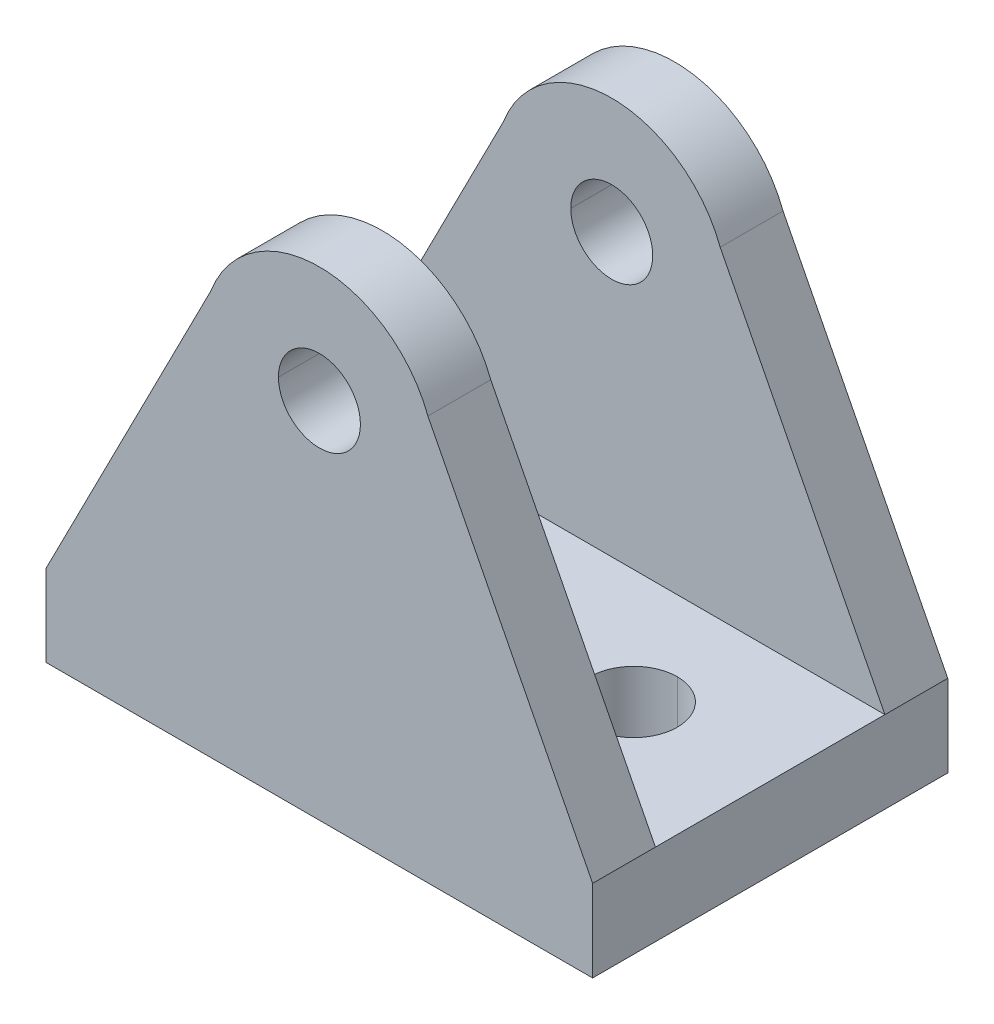
ISO-10303-21;
HEADER;
FILE_DESCRIPTION(('STEP AP214'),'2;1');
FILE_NAME('part.step','',(''),(''),'','','');
FILE_SCHEMA(('AUTOMOTIVE_DESIGN { 1 0 10303 214 1 1 1 1 }'));
ENDSEC;
DATA;
#1=APPLICATION_CONTEXT('core data for automotive mechanical design processes');
#2=APPLICATION_PROTOCOL_DEFINITION('international standard','automotive_design',2000,#1);
#3=PRODUCT_CONTEXT('',#1,'mechanical');
#4=PRODUCT('Part','Part','',(#3));
#5=PRODUCT_RELATED_PRODUCT_CATEGORY('part','',(#4));
#6=PRODUCT_DEFINITION_FORMATION('','',#4);
#7=PRODUCT_DEFINITION_CONTEXT('part definition',#1,'design');
#8=PRODUCT_DEFINITION('design','',#6,#7);
#9=PRODUCT_DEFINITION_SHAPE('','',#8);
#10=(LENGTH_UNIT() NAMED_UNIT(*) SI_UNIT(.MILLI.,.METRE.));
#11=(NAMED_UNIT(*) PLANE_ANGLE_UNIT() SI_UNIT($,.RADIAN.));
#12=(NAMED_UNIT(*) SI_UNIT($,.STERADIAN.) SOLID_ANGLE_UNIT());
#13=UNCERTAINTY_MEASURE_WITH_UNIT(LENGTH_MEASURE(1.E-05),#10,'distance_accuracy_value','');
#14=(GEOMETRIC_REPRESENTATION_CONTEXT(3) GLOBAL_UNCERTAINTY_ASSIGNED_CONTEXT((#13)) GLOBAL_UNIT_ASSIGNED_CONTEXT((#10,
#11,#12)) REPRESENTATION_CONTEXT('',''));
#15=CARTESIAN_POINT('',(0.,0.,0.));
#16=DIRECTION('',(0.,0.,1.));
#17=DIRECTION('',(1.,0.,0.));
#18=AXIS2_PLACEMENT_3D('',#15,#16,#17);
#19=CARTESIAN_POINT('',(16.3430756374336,3.,-51.9194258680596));
#20=DIRECTION('',(0.,0.,-1.));
#21=DIRECTION('',(0.,-1.,0.));
#22=AXIS2_PLACEMENT_3D('',#19,#20,#21);
#23=PLANE('',#22);
#24=CARTESIAN_POINT('',(35.3430691595237,13.3000053075812,-51.9194258680596));
#25=DIRECTION('',(0.,0.,-1.));
#26=DIRECTION('',(-1.,0.,0.));
#27=AXIS2_PLACEMENT_3D('',#24,#25,#26);
#28=CIRCLE('',#27,1.50000000000006);
#29=CARTESIAN_POINT('',(36.8430691595238,13.3000053075812,-51.9194258680596));
#30=VERTEX_POINT('',#29);
#31=CARTESIAN_POINT('',(33.8430691595237,13.3000053075812,-51.9194258680596));
#32=VERTEX_POINT('',#31);
#33=EDGE_CURVE('E210',#30,#32,#28,.T.);
#34=ORIENTED_EDGE('',*,*,#33,.T.);
#35=CARTESIAN_POINT('',(35.3430691595237,13.3000053075812,-51.9194258680596));
#36=DIRECTION('',(0.,0.,-1.));
#37=DIRECTION('',(-1.,0.,0.));
#38=AXIS2_PLACEMENT_3D('',#35,#36,#37);
#39=CIRCLE('',#38,1.50000000000006);
#40=EDGE_CURVE('E11',#32,#30,#39,.T.);
#41=ORIENTED_EDGE('',*,*,#40,.T.);
#42=EDGE_LOOP('',(#34,#41));
#43=FACE_BOUND('',#42,.T.);
#44=DIRECTION('',(1.,0.,0.));
#45=VECTOR('',#44,1.);
#46=CARTESIAN_POINT('',(16.3430756374336,3.,-51.9194258680596));
#47=LINE('',#46,#45);
#48=CARTESIAN_POINT('',(25.3430756374336,3.,-51.9194258680596));
#49=VERTEX_POINT('',#48);
#50=CARTESIAN_POINT('',(45.3430756374336,3.,-51.9194258680596));
#51=VERTEX_POINT('',#50);
#52=EDGE_CURVE('E366',#49,#51,#47,.T.);
#53=ORIENTED_EDGE('',*,*,#52,.T.);
#54=DIRECTION('',(0.454991131058374,-0.890495968917446,0.));
#55=VECTOR('',#54,1.);
#56=CARTESIAN_POINT('',(45.3430756374336,3.,-51.9194258680596));
#57=LINE('',#56,#55);
#58=CARTESIAN_POINT('',(39.313966075132,14.8000053075813,-51.9194258680596));
#59=VERTEX_POINT('',#58);
#60=EDGE_CURVE('E26',#59,#51,#57,.T.);
#61=ORIENTED_EDGE('',*,*,#60,.F.);
#62=CARTESIAN_POINT('',(35.3430691595237,13.3000053075812,-51.9194258680596));
#63=DIRECTION('',(0.,0.,-1.));
#64=DIRECTION('',(-1.,0.,0.));
#65=AXIS2_PLACEMENT_3D('',#62,#63,#64);
#66=CIRCLE('',#65,4.24476410585876);
#67=CARTESIAN_POINT('',(31.3721722439155,14.8000053075813,-51.9194258680596));
#68=VERTEX_POINT('',#67);
#69=EDGE_CURVE('E244',#68,#59,#66,.T.);
#70=ORIENTED_EDGE('',*,*,#69,.F.);
#71=DIRECTION('',(0.454990355742183,0.890496365058051,0.));
#72=VECTOR('',#71,1.);
#73=CARTESIAN_POINT('',(31.3721722439155,14.8000053075813,-51.9194258680596));
#74=LINE('',#73,#72);
#75=EDGE_CURVE('E245',#49,#68,#74,.T.);
#76=ORIENTED_EDGE('',*,*,#75,.F.);
#77=EDGE_LOOP('',(#53,#61,#70,#76));
#78=FACE_BOUND('',#77,.T.);
#79=ADVANCED_FACE('F16',(#43,#78),#23,.F.);
#80=CARTESIAN_POINT('',(16.3430756374336,3.,-43.5194258680597));
#81=DIRECTION('',(0.,0.,1.));
#82=DIRECTION('',(1.,0.,0.));
#83=AXIS2_PLACEMENT_3D('',#80,#81,#82);
#84=PLANE('',#83);
#85=CARTESIAN_POINT('',(35.3430756374336,13.3,-43.5194258680597));
#86=DIRECTION('',(0.,0.,1.));
#87=DIRECTION('',(1.,0.,0.));
#88=AXIS2_PLACEMENT_3D('',#85,#86,#87);
#89=CIRCLE('',#88,1.50000000000006);
#90=CARTESIAN_POINT('',(33.8430756374335,13.3,-43.5194258680597));
#91=VERTEX_POINT('',#90);
#92=CARTESIAN_POINT('',(36.8430756374336,13.3,-43.5194258680597));
#93=VERTEX_POINT('',#92);
#94=EDGE_CURVE('E402',#91,#93,#89,.T.);
#95=ORIENTED_EDGE('',*,*,#94,.T.);
#96=CARTESIAN_POINT('',(35.3430756374336,13.3,-43.5194258680597));
#97=DIRECTION('',(0.,0.,1.));
#98=DIRECTION('',(1.,0.,0.));
#99=AXIS2_PLACEMENT_3D('',#96,#97,#98);
#100=CIRCLE('',#99,1.50000000000006);
#101=EDGE_CURVE('E257',#93,#91,#100,.T.);
#102=ORIENTED_EDGE('',*,*,#101,.T.);
#103=EDGE_LOOP('',(#95,#102));
#104=FACE_BOUND('',#103,.T.);
#105=DIRECTION('',(1.,0.,0.));
#106=VECTOR('',#105,1.);
#107=CARTESIAN_POINT('',(16.3430756374336,3.,-43.5194258680597));
#108=LINE('',#107,#106);
#109=CARTESIAN_POINT('',(25.3430756374336,3.,-43.5194258680597));
#110=VERTEX_POINT('',#109);
#111=CARTESIAN_POINT('',(45.3430756374336,3.,-43.5194258680597));
#112=VERTEX_POINT('',#111);
#113=EDGE_CURVE('E299',#110,#112,#108,.T.);
#114=ORIENTED_EDGE('',*,*,#113,.F.);
#115=DIRECTION('',(-0.45499090568648,-0.890496084069209,0.));
#116=VECTOR('',#115,1.);
#117=CARTESIAN_POINT('',(25.3430756374336,3.,-43.5194258680597));
#118=LINE('',#117,#116);
#119=CARTESIAN_POINT('',(31.3721787218253,14.8,-43.5194258680597));
#120=VERTEX_POINT('',#119);
#121=EDGE_CURVE('E261',#120,#110,#118,.T.);
#122=ORIENTED_EDGE('',*,*,#121,.F.);
#123=CARTESIAN_POINT('',(35.3430756374336,13.3,-43.5194258680597));
#124=DIRECTION('',(0.,0.,1.));
#125=DIRECTION('',(1.,0.,0.));
#126=AXIS2_PLACEMENT_3D('',#123,#124,#125);
#127=CIRCLE('',#126,4.24476410585876);
#128=CARTESIAN_POINT('',(39.3139725530418,14.8,-43.5194258680597));
#129=VERTEX_POINT('',#128);
#130=EDGE_CURVE('E229',#129,#120,#127,.T.);
#131=ORIENTED_EDGE('',*,*,#130,.F.);
#132=DIRECTION('',(-0.45499090568648,0.890496084069209,0.));
#133=VECTOR('',#132,1.);
#134=CARTESIAN_POINT('',(39.3139725530418,14.8,-43.5194258680597));
#135=LINE('',#134,#133);
#136=EDGE_CURVE('E230',#112,#129,#135,.T.);
#137=ORIENTED_EDGE('',*,*,#136,.F.);
#138=EDGE_LOOP('',(#114,#122,#131,#137));
#139=FACE_BOUND('',#138,.T.);
#140=ADVANCED_FACE('F459',(#104,#139),#84,.F.);
#141=CARTESIAN_POINT('',(35.3430691595237,13.3000053075812,-54.2194258680596));
#142=DIRECTION('',(0.,0.,1.));
#143=DIRECTION('',(1.,0.,0.));
#144=AXIS2_PLACEMENT_3D('',#141,#142,#143);
#145=CYLINDRICAL_SURFACE('',#144,1.50000000000006);
#146=DIRECTION('',(0.,0.,1.));
#147=VECTOR('',#146,1.);
#148=CARTESIAN_POINT('',(33.8430691595237,13.3000053075812,-54.2194258680596));
#149=LINE('',#148,#147);
#150=CARTESIAN_POINT('',(33.8430691595237,13.3000053075812,-54.2194258680596));
#151=VERTEX_POINT('',#150);
#152=EDGE_CURVE('E204',#151,#32,#149,.T.);
#153=ORIENTED_EDGE('',*,*,#152,.F.);
#154=CARTESIAN_POINT('',(35.3430691595237,13.3000053075812,-54.2194258680596));
#155=DIRECTION('',(0.,0.,-1.));
#156=DIRECTION('',(-1.,0.,0.));
#157=AXIS2_PLACEMENT_3D('',#154,#155,#156);
#158=CIRCLE('',#157,1.50000000000006);
#159=CARTESIAN_POINT('',(36.8430691595238,13.3000053075812,-54.2194258680596));
#160=VERTEX_POINT('',#159);
#161=EDGE_CURVE('E388',#151,#160,#158,.T.);
#162=ORIENTED_EDGE('',*,*,#161,.T.);
#163=DIRECTION('',(0.,0.,1.));
#164=VECTOR('',#163,1.);
#165=CARTESIAN_POINT('',(36.8430691595238,13.3000053075812,-54.2194258680596));
#166=LINE('',#165,#164);
#167=EDGE_CURVE('E207',#160,#30,#166,.T.);
#168=ORIENTED_EDGE('',*,*,#167,.T.);
#169=ORIENTED_EDGE('',*,*,#40,.F.);
#170=EDGE_LOOP('',(#153,#162,#168,#169));
#171=FACE_BOUND('',#170,.T.);
#172=ADVANCED_FACE('F202',(#171),#145,.F.);
#173=CARTESIAN_POINT('',(45.3430756374336,3.,-54.2194258680596));
#174=DIRECTION('',(-0.890495968917446,-0.454991131058374,0.));
#175=DIRECTION('',(-0.454991131058374,0.890495968917446,0.));
#176=AXIS2_PLACEMENT_3D('',#173,#174,#175);
#177=PLANE('',#176);
#178=DIRECTION('',(0.,0.,1.));
#179=VECTOR('',#178,1.);
#180=CARTESIAN_POINT('',(39.313966075132,14.8000053075813,-54.2194258680596));
#181=LINE('',#180,#179);
#182=CARTESIAN_POINT('',(39.313966075132,14.8000053075813,-54.2194258680596));
#183=VERTEX_POINT('',#182);
#184=EDGE_CURVE('E294',#183,#59,#181,.T.);
#185=ORIENTED_EDGE('',*,*,#184,.T.);
#186=ORIENTED_EDGE('',*,*,#60,.T.);
#187=DIRECTION('',(0.,0.,1.));
#188=VECTOR('',#187,1.);
#189=CARTESIAN_POINT('',(45.3430756374336,3.,-54.2194258680596));
#190=LINE('',#189,#188);
#191=CARTESIAN_POINT('',(45.3430756374336,3.,-54.2194258680596));
#192=VERTEX_POINT('',#191);
#193=EDGE_CURVE('E282',#192,#51,#190,.T.);
#194=ORIENTED_EDGE('',*,*,#193,.F.);
#195=DIRECTION('',(0.454991131058374,-0.890495968917446,0.));
#196=VECTOR('',#195,1.);
#197=CARTESIAN_POINT('',(45.3430756374336,3.,-54.2194258680596));
#198=LINE('',#197,#196);
#199=EDGE_CURVE('E19',#183,#192,#198,.T.);
#200=ORIENTED_EDGE('',*,*,#199,.F.);
#201=EDGE_LOOP('',(#185,#186,#194,#200));
#202=FACE_BOUND('',#201,.T.);
#203=ADVANCED_FACE('F480',(#202),#177,.F.);
#204=CARTESIAN_POINT('',(35.3430691595237,13.3000053075812,-54.2194258680596));
#205=DIRECTION('',(0.,0.,1.));
#206=DIRECTION('',(1.,0.,0.));
#207=AXIS2_PLACEMENT_3D('',#204,#205,#206);
#208=CYLINDRICAL_SURFACE('',#207,4.24476410585876);
#209=DIRECTION('',(0.,0.,1.));
#210=VECTOR('',#209,1.);
#211=CARTESIAN_POINT('',(31.3721722439155,14.8000053075813,-54.2194258680596));
#212=LINE('',#211,#210);
#213=CARTESIAN_POINT('',(31.3721722439155,14.8000053075813,-54.2194258680596));
#214=VERTEX_POINT('',#213);
#215=EDGE_CURVE('E240',#214,#68,#212,.T.);
#216=ORIENTED_EDGE('',*,*,#215,.T.);
#217=ORIENTED_EDGE('',*,*,#69,.T.);
#218=ORIENTED_EDGE('',*,*,#184,.F.);
#219=CARTESIAN_POINT('',(35.3430691595237,13.3000053075812,-54.2194258680596));
#220=DIRECTION('',(0.,0.,-1.));
#221=DIRECTION('',(1.,0.,0.));
#222=AXIS2_PLACEMENT_3D('',#219,#220,#221);
#223=CIRCLE('',#222,4.24476410585876);
#224=EDGE_CURVE('E271',#214,#183,#223,.T.);
#225=ORIENTED_EDGE('',*,*,#224,.F.);
#226=EDGE_LOOP('',(#216,#217,#218,#225));
#227=FACE_BOUND('',#226,.T.);
#228=ADVANCED_FACE('F493',(#227),#208,.T.);
#229=CARTESIAN_POINT('',(31.3721722439155,14.8000053075813,-54.2194258680596));
#230=DIRECTION('',(0.890496365058051,-0.454990355742182,0.));
#231=DIRECTION('',(0.,0.,-1.));
#232=AXIS2_PLACEMENT_3D('',#229,#230,#231);
#233=PLANE('',#232);
#234=DIRECTION('',(0.,0.,1.));
#235=VECTOR('',#234,1.);
#236=CARTESIAN_POINT('',(25.3430756374336,3.,-54.2194258680596));
#237=LINE('',#236,#235);
#238=CARTESIAN_POINT('',(25.3430756374336,3.,-54.2194258680596));
#239=VERTEX_POINT('',#238);
#240=EDGE_CURVE('E262',#239,#49,#237,.T.);
#241=ORIENTED_EDGE('',*,*,#240,.T.);
#242=ORIENTED_EDGE('',*,*,#75,.T.);
#243=ORIENTED_EDGE('',*,*,#215,.F.);
#244=DIRECTION('',(0.454990355742183,0.890496365058051,0.));
#245=VECTOR('',#244,1.);
#246=CARTESIAN_POINT('',(31.3721722439155,14.8000053075813,-54.2194258680596));
#247=LINE('',#246,#245);
#248=EDGE_CURVE('E260',#239,#214,#247,.T.);
#249=ORIENTED_EDGE('',*,*,#248,.F.);
#250=EDGE_LOOP('',(#241,#242,#243,#249));
#251=FACE_BOUND('',#250,.T.);
#252=ADVANCED_FACE('F456',(#251),#233,.F.);
#253=CARTESIAN_POINT('',(35.3430691595237,13.3000053075812,-54.2194258680596));
#254=DIRECTION('',(0.,0.,1.));
#255=DIRECTION('',(1.,0.,0.));
#256=AXIS2_PLACEMENT_3D('',#253,#254,#255);
#257=PLANE('',#256);
#258=CARTESIAN_POINT('',(35.3430691595237,13.3000053075812,-54.2194258680596));
#259=DIRECTION('',(0.,0.,-1.));
#260=DIRECTION('',(-1.,0.,0.));
#261=AXIS2_PLACEMENT_3D('',#258,#259,#260);
#262=CIRCLE('',#261,1.50000000000006);
#263=EDGE_CURVE('E216',#160,#151,#262,.T.);
#264=ORIENTED_EDGE('',*,*,#263,.F.);
#265=ORIENTED_EDGE('',*,*,#161,.F.);
#266=EDGE_LOOP('',(#264,#265));
#267=FACE_BOUND('',#266,.T.);
#268=DIRECTION('',(0.,-1.,0.));
#269=VECTOR('',#268,1.);
#270=CARTESIAN_POINT('',(45.3430756374336,3.,-54.2194258680596));
#271=LINE('',#270,#269);
#272=CARTESIAN_POINT('',(45.3430756374336,0.,-54.2194258680596));
#273=VERTEX_POINT('',#272);
#274=EDGE_CURVE('E287',#192,#273,#271,.T.);
#275=ORIENTED_EDGE('',*,*,#274,.T.);
#276=DIRECTION('',(-1.,0.,0.));
#277=VECTOR('',#276,1.);
#278=CARTESIAN_POINT('',(45.3430756374336,0.,-54.2194258680596));
#279=LINE('',#278,#277);
#280=CARTESIAN_POINT('',(25.3430756374336,0.,-54.2194258680596));
#281=VERTEX_POINT('',#280);
#282=EDGE_CURVE('E255',#273,#281,#279,.T.);
#283=ORIENTED_EDGE('',*,*,#282,.T.);
#284=DIRECTION('',(0.,1.,0.));
#285=VECTOR('',#284,1.);
#286=CARTESIAN_POINT('',(25.3430756374336,3.,-54.2194258680596));
#287=LINE('',#286,#285);
#288=EDGE_CURVE('E266',#281,#239,#287,.T.);
#289=ORIENTED_EDGE('',*,*,#288,.T.);
#290=ORIENTED_EDGE('',*,*,#248,.T.);
#291=ORIENTED_EDGE('',*,*,#224,.T.);
#292=ORIENTED_EDGE('',*,*,#199,.T.);
#293=EDGE_LOOP('',(#275,#283,#289,#290,#291,#292));
#294=FACE_BOUND('',#293,.T.);
#295=ADVANCED_FACE('F485',(#267,#294),#257,.F.);
#296=CARTESIAN_POINT('',(35.3430756374336,13.3,-41.2194258680597));
#297=DIRECTION('',(0.,0.,-1.));
#298=DIRECTION('',(-1.,0.,0.));
#299=AXIS2_PLACEMENT_3D('',#296,#297,#298);
#300=CYLINDRICAL_SURFACE('',#299,1.50000000000006);
#301=DIRECTION('',(0.,0.,-1.));
#302=VECTOR('',#301,1.);
#303=CARTESIAN_POINT('',(36.8430756374336,13.3,-41.2194258680597));
#304=LINE('',#303,#302);
#305=CARTESIAN_POINT('',(36.8430756374336,13.3,-41.2194258680597));
#306=VERTEX_POINT('',#305);
#307=EDGE_CURVE('E235',#306,#93,#304,.T.);
#308=ORIENTED_EDGE('',*,*,#307,.F.);
#309=CARTESIAN_POINT('',(35.3430756374336,13.3,-41.2194258680597));
#310=DIRECTION('',(0.,0.,1.));
#311=DIRECTION('',(1.,0.,0.));
#312=AXIS2_PLACEMENT_3D('',#309,#310,#311);
#313=CIRCLE('',#312,1.50000000000006);
#314=CARTESIAN_POINT('',(33.8430756374335,13.3,-41.2194258680597));
#315=VERTEX_POINT('',#314);
#316=EDGE_CURVE('E236',#306,#315,#313,.T.);
#317=ORIENTED_EDGE('',*,*,#316,.T.);
#318=DIRECTION('',(0.,0.,-1.));
#319=VECTOR('',#318,1.);
#320=CARTESIAN_POINT('',(33.8430756374335,13.3,-41.2194258680597));
#321=LINE('',#320,#319);
#322=EDGE_CURVE('E226',#315,#91,#321,.T.);
#323=ORIENTED_EDGE('',*,*,#322,.T.);
#324=ORIENTED_EDGE('',*,*,#101,.F.);
#325=EDGE_LOOP('',(#308,#317,#323,#324));
#326=FACE_BOUND('',#325,.T.);
#327=ADVANCED_FACE('F419',(#326),#300,.F.);
#328=CARTESIAN_POINT('',(25.3430756374336,3.,-41.2194258680597));
#329=DIRECTION('',(0.890496084069209,-0.45499090568648,0.));
#330=DIRECTION('',(0.,0.,-1.));
#331=AXIS2_PLACEMENT_3D('',#328,#329,#330);
#332=PLANE('',#331);
#333=DIRECTION('',(0.,0.,-1.));
#334=VECTOR('',#333,1.);
#335=CARTESIAN_POINT('',(31.3721787218253,14.8,-41.2194258680597));
#336=LINE('',#335,#334);
#337=CARTESIAN_POINT('',(31.3721787218253,14.8,-41.2194258680597));
#338=VERTEX_POINT('',#337);
#339=EDGE_CURVE('E118',#338,#120,#336,.T.);
#340=ORIENTED_EDGE('',*,*,#339,.T.);
#341=ORIENTED_EDGE('',*,*,#121,.T.);
#342=DIRECTION('',(0.,0.,-1.));
#343=VECTOR('',#342,1.);
#344=CARTESIAN_POINT('',(25.3430756374336,3.,-41.2194258680597));
#345=LINE('',#344,#343);
#346=CARTESIAN_POINT('',(25.3430756374336,3.,-41.2194258680597));
#347=VERTEX_POINT('',#346);
#348=EDGE_CURVE('E267',#347,#110,#345,.T.);
#349=ORIENTED_EDGE('',*,*,#348,.F.);
#350=DIRECTION('',(-0.45499090568648,-0.890496084069209,0.));
#351=VECTOR('',#350,1.);
#352=CARTESIAN_POINT('',(25.3430756374336,3.,-41.2194258680597));
#353=LINE('',#352,#351);
#354=EDGE_CURVE('E239',#338,#347,#353,.T.);
#355=ORIENTED_EDGE('',*,*,#354,.F.);
#356=EDGE_LOOP('',(#340,#341,#349,#355));
#357=FACE_BOUND('',#356,.T.);
#358=ADVANCED_FACE('F458',(#357),#332,.F.);
#359=CARTESIAN_POINT('',(35.3430756374336,13.3,-41.2194258680597));
#360=DIRECTION('',(0.,0.,-1.));
#361=DIRECTION('',(-1.,0.,0.));
#362=AXIS2_PLACEMENT_3D('',#359,#360,#361);
#363=CYLINDRICAL_SURFACE('',#362,4.24476410585876);
#364=DIRECTION('',(0.,0.,-1.));
#365=VECTOR('',#364,1.);
#366=CARTESIAN_POINT('',(39.3139725530418,14.8,-41.2194258680597));
#367=LINE('',#366,#365);
#368=CARTESIAN_POINT('',(39.3139725530418,14.8,-41.2194258680597));
#369=VERTEX_POINT('',#368);
#370=EDGE_CURVE('E131',#369,#129,#367,.T.);
#371=ORIENTED_EDGE('',*,*,#370,.T.);
#372=ORIENTED_EDGE('',*,*,#130,.T.);
#373=ORIENTED_EDGE('',*,*,#339,.F.);
#374=CARTESIAN_POINT('',(35.3430756374336,13.3,-41.2194258680597));
#375=DIRECTION('',(0.,0.,1.));
#376=DIRECTION('',(-1.,0.,0.));
#377=AXIS2_PLACEMENT_3D('',#374,#375,#376);
#378=CIRCLE('',#377,4.24476410585876);
#379=EDGE_CURVE('E295',#369,#338,#378,.T.);
#380=ORIENTED_EDGE('',*,*,#379,.F.);
#381=EDGE_LOOP('',(#371,#372,#373,#380));
#382=FACE_BOUND('',#381,.T.);
#383=ADVANCED_FACE('F460',(#382),#363,.T.);
#384=CARTESIAN_POINT('',(39.3139725530418,14.8,-41.2194258680597));
#385=DIRECTION('',(-0.890496084069209,-0.45499090568648,0.));
#386=DIRECTION('',(-0.45499090568648,0.890496084069209,0.));
#387=AXIS2_PLACEMENT_3D('',#384,#385,#386);
#388=PLANE('',#387);
#389=DIRECTION('',(0.,0.,-1.));
#390=VECTOR('',#389,1.);
#391=CARTESIAN_POINT('',(45.3430756374336,3.,-41.2194258680597));
#392=LINE('',#391,#390);
#393=CARTESIAN_POINT('',(45.3430756374336,3.,-41.2194258680597));
#394=VERTEX_POINT('',#393);
#395=EDGE_CURVE('E286',#394,#112,#392,.T.);
#396=ORIENTED_EDGE('',*,*,#395,.T.);
#397=ORIENTED_EDGE('',*,*,#136,.T.);
#398=ORIENTED_EDGE('',*,*,#370,.F.);
#399=DIRECTION('',(-0.45499090568648,0.890496084069209,0.));
#400=VECTOR('',#399,1.);
#401=CARTESIAN_POINT('',(39.3139725530418,14.8,-41.2194258680597));
#402=LINE('',#401,#400);
#403=EDGE_CURVE('E275',#394,#369,#402,.T.);
#404=ORIENTED_EDGE('',*,*,#403,.F.);
#405=EDGE_LOOP('',(#396,#397,#398,#404));
#406=FACE_BOUND('',#405,.T.);
#407=ADVANCED_FACE('F428',(#406),#388,.F.);
#408=CARTESIAN_POINT('',(35.3430756374336,13.3,-41.2194258680597));
#409=DIRECTION('',(0.,0.,-1.));
#410=DIRECTION('',(0.,-1.,0.));
#411=AXIS2_PLACEMENT_3D('',#408,#409,#410);
#412=PLANE('',#411);
#413=CARTESIAN_POINT('',(35.3430756374336,13.3,-41.2194258680597));
#414=DIRECTION('',(0.,0.,1.));
#415=DIRECTION('',(1.,0.,0.));
#416=AXIS2_PLACEMENT_3D('',#413,#414,#415);
#417=CIRCLE('',#416,1.50000000000006);
#418=EDGE_CURVE('E231',#315,#306,#417,.T.);
#419=ORIENTED_EDGE('',*,*,#418,.F.);
#420=ORIENTED_EDGE('',*,*,#316,.F.);
#421=EDGE_LOOP('',(#419,#420));
#422=FACE_BOUND('',#421,.T.);
#423=DIRECTION('',(0.,-1.,0.));
#424=VECTOR('',#423,1.);
#425=CARTESIAN_POINT('',(25.3430756374336,3.,-41.2194258680597));
#426=LINE('',#425,#424);
#427=CARTESIAN_POINT('',(25.3430756374336,0.,-41.2194258680597));
#428=VERTEX_POINT('',#427);
#429=EDGE_CURVE('E278',#347,#428,#426,.T.);
#430=ORIENTED_EDGE('',*,*,#429,.T.);
#431=DIRECTION('',(1.,0.,0.));
#432=VECTOR('',#431,1.);
#433=CARTESIAN_POINT('',(25.3430756374336,0.,-41.2194258680597));
#434=LINE('',#433,#432);
#435=CARTESIAN_POINT('',(45.3430756374336,0.,-41.2194258680597));
#436=VERTEX_POINT('',#435);
#437=EDGE_CURVE('E256',#428,#436,#434,.T.);
#438=ORIENTED_EDGE('',*,*,#437,.T.);
#439=DIRECTION('',(0.,1.,0.));
#440=VECTOR('',#439,1.);
#441=CARTESIAN_POINT('',(45.3430756374336,3.,-41.2194258680597));
#442=LINE('',#441,#440);
#443=EDGE_CURVE('E281',#436,#394,#442,.T.);
#444=ORIENTED_EDGE('',*,*,#443,.T.);
#445=ORIENTED_EDGE('',*,*,#403,.T.);
#446=ORIENTED_EDGE('',*,*,#379,.T.);
#447=ORIENTED_EDGE('',*,*,#354,.T.);
#448=EDGE_LOOP('',(#430,#438,#444,#445,#446,#447));
#449=FACE_BOUND('',#448,.T.);
#450=ADVANCED_FACE('F424',(#422,#449),#412,.F.);
#451=CARTESIAN_POINT('',(30.3430756374335,3.,-47.7194258680598));
#452=DIRECTION('',(0.,-1.,0.));
#453=DIRECTION('',(0.,0.,-1.));
#454=AXIS2_PLACEMENT_3D('',#451,#452,#453);
#455=CYLINDRICAL_SURFACE('',#454,1.59999999999983);
#456=DIRECTION('',(0.,-1.,0.));
#457=VECTOR('',#456,1.);
#458=CARTESIAN_POINT('',(30.3430756374335,3.,-46.1194258680599));
#459=LINE('',#458,#457);
#460=CARTESIAN_POINT('',(30.3430756374335,3.,-46.1194258680599));
#461=VERTEX_POINT('',#460);
#462=CARTESIAN_POINT('',(30.3430756374335,0.,-46.1194258680599));
#463=VERTEX_POINT('',#462);
#464=EDGE_CURVE('E323',#461,#463,#459,.T.);
#465=ORIENTED_EDGE('',*,*,#464,.F.);
#466=CARTESIAN_POINT('',(30.3430756374335,3.,-47.7194258680598));
#467=DIRECTION('',(0.,1.,0.));
#468=DIRECTION('',(0.,0.,1.));
#469=AXIS2_PLACEMENT_3D('',#466,#467,#468);
#470=CIRCLE('',#469,1.59999999999983);
#471=CARTESIAN_POINT('',(30.3430756374335,3.,-49.3194258680596));
#472=VERTEX_POINT('',#471);
#473=EDGE_CURVE('E332',#461,#472,#470,.T.);
#474=ORIENTED_EDGE('',*,*,#473,.T.);
#475=DIRECTION('',(0.,-1.,0.));
#476=VECTOR('',#475,1.);
#477=CARTESIAN_POINT('',(30.3430756374335,3.,-49.3194258680596));
#478=LINE('',#477,#476);
#479=CARTESIAN_POINT('',(30.3430756374335,0.,-49.3194258680596));
#480=VERTEX_POINT('',#479);
#481=EDGE_CURVE('E311',#472,#480,#478,.T.);
#482=ORIENTED_EDGE('',*,*,#481,.T.);
#483=CARTESIAN_POINT('',(30.3430756374335,0.,-47.7194258680598));
#484=DIRECTION('',(0.,1.,0.));
#485=DIRECTION('',(0.,0.,1.));
#486=AXIS2_PLACEMENT_3D('',#483,#484,#485);
#487=CIRCLE('',#486,1.59999999999983);
#488=EDGE_CURVE('E317',#463,#480,#487,.T.);
#489=ORIENTED_EDGE('',*,*,#488,.F.);
#490=EDGE_LOOP('',(#465,#474,#482,#489));
#491=FACE_BOUND('',#490,.T.);
#492=ADVANCED_FACE('F427',(#491),#455,.F.);
#493=CARTESIAN_POINT('',(40.3430756374337,3.,-47.7194258680598));
#494=DIRECTION('',(0.,-1.,0.));
#495=DIRECTION('',(0.,0.,-1.));
#496=AXIS2_PLACEMENT_3D('',#493,#494,#495);
#497=CYLINDRICAL_SURFACE('',#496,1.59999999999983);
#498=DIRECTION('',(0.,-1.,0.));
#499=VECTOR('',#498,1.);
#500=CARTESIAN_POINT('',(40.3430756374337,3.,-46.1194258680599));
#501=LINE('',#500,#499);
#502=CARTESIAN_POINT('',(40.3430756374337,3.,-46.1194258680599));
#503=VERTEX_POINT('',#502);
#504=CARTESIAN_POINT('',(40.3430756374337,0.,-46.1194258680599));
#505=VERTEX_POINT('',#504);
#506=EDGE_CURVE('E250',#503,#505,#501,.T.);
#507=ORIENTED_EDGE('',*,*,#506,.F.);
#508=CARTESIAN_POINT('',(40.3430756374337,3.,-47.7194258680598));
#509=DIRECTION('',(0.,1.,0.));
#510=DIRECTION('',(0.,0.,1.));
#511=AXIS2_PLACEMENT_3D('',#508,#509,#510);
#512=CIRCLE('',#511,1.59999999999983);
#513=CARTESIAN_POINT('',(40.3430756374337,3.,-49.3194258680596));
#514=VERTEX_POINT('',#513);
#515=EDGE_CURVE('E303',#503,#514,#512,.T.);
#516=ORIENTED_EDGE('',*,*,#515,.T.);
#517=DIRECTION('',(0.,-1.,0.));
#518=VECTOR('',#517,1.);
#519=CARTESIAN_POINT('',(40.3430756374337,3.,-49.3194258680596));
#520=LINE('',#519,#518);
#521=CARTESIAN_POINT('',(40.3430756374337,0.,-49.3194258680596));
#522=VERTEX_POINT('',#521);
#523=EDGE_CURVE('E249',#514,#522,#520,.T.);
#524=ORIENTED_EDGE('',*,*,#523,.T.);
#525=CARTESIAN_POINT('',(40.3430756374337,0.,-47.7194258680598));
#526=DIRECTION('',(0.,1.,0.));
#527=DIRECTION('',(0.,0.,1.));
#528=AXIS2_PLACEMENT_3D('',#525,#526,#527);
#529=CIRCLE('',#528,1.59999999999983);
#530=EDGE_CURVE('E183',#505,#522,#529,.T.);
#531=ORIENTED_EDGE('',*,*,#530,.F.);
#532=EDGE_LOOP('',(#507,#516,#524,#531));
#533=FACE_BOUND('',#532,.T.);
#534=ADVANCED_FACE('F513',(#533),#497,.F.);
#535=CARTESIAN_POINT('',(25.3430756374336,3.,-51.2194258680596));
#536=DIRECTION('',(1.,0.,0.));
#537=DIRECTION('',(0.,1.,0.));
#538=AXIS2_PLACEMENT_3D('',#535,#536,#537);
#539=PLANE('',#538);
#540=DIRECTION('',(0.,0.,1.));
#541=VECTOR('',#540,1.);
#542=CARTESIAN_POINT('',(25.3430756374336,0.,-51.2194258680596));
#543=LINE('',#542,#541);
#544=EDGE_CURVE('E251',#281,#428,#543,.T.);
#545=ORIENTED_EDGE('',*,*,#544,.T.);
#546=ORIENTED_EDGE('',*,*,#429,.F.);
#547=ORIENTED_EDGE('',*,*,#348,.T.);
#548=DIRECTION('',(0.,0.,1.));
#549=VECTOR('',#548,1.);
#550=CARTESIAN_POINT('',(25.3430756374336,3.,-51.2194258680596));
#551=LINE('',#550,#549);
#552=EDGE_CURVE('E304',#49,#110,#551,.T.);
#553=ORIENTED_EDGE('',*,*,#552,.F.);
#554=ORIENTED_EDGE('',*,*,#240,.F.);
#555=ORIENTED_EDGE('',*,*,#288,.F.);
#556=EDGE_LOOP('',(#545,#546,#547,#553,#554,#555));
#557=FACE_BOUND('',#556,.T.);
#558=ADVANCED_FACE('F436',(#557),#539,.F.);
#559=CARTESIAN_POINT('',(45.3430756374336,3.,-51.2194258680596));
#560=DIRECTION('',(-1.,0.,0.));
#561=DIRECTION('',(0.,0.,1.));
#562=AXIS2_PLACEMENT_3D('',#559,#560,#561);
#563=PLANE('',#562);
#564=DIRECTION('',(0.,0.,-1.));
#565=VECTOR('',#564,1.);
#566=CARTESIAN_POINT('',(45.3430756374336,0.,-51.2194258680596));
#567=LINE('',#566,#565);
#568=EDGE_CURVE('E335',#436,#273,#567,.T.);
#569=ORIENTED_EDGE('',*,*,#568,.T.);
#570=ORIENTED_EDGE('',*,*,#274,.F.);
#571=ORIENTED_EDGE('',*,*,#193,.T.);
#572=DIRECTION('',(0.,0.,-1.));
#573=VECTOR('',#572,1.);
#574=CARTESIAN_POINT('',(45.3430756374336,3.,-51.2194258680596));
#575=LINE('',#574,#573);
#576=EDGE_CURVE('E372',#112,#51,#575,.T.);
#577=ORIENTED_EDGE('',*,*,#576,.F.);
#578=ORIENTED_EDGE('',*,*,#395,.F.);
#579=ORIENTED_EDGE('',*,*,#443,.F.);
#580=EDGE_LOOP('',(#569,#570,#571,#577,#578,#579));
#581=FACE_BOUND('',#580,.T.);
#582=ADVANCED_FACE('F443',(#581),#563,.F.);
#583=CARTESIAN_POINT('',(0.,0.,0.));
#584=DIRECTION('',(0.,-1.,0.));
#585=DIRECTION('',(0.,0.,-1.));
#586=AXIS2_PLACEMENT_3D('',#583,#584,#585);
#587=PLANE('',#586);
#588=CARTESIAN_POINT('',(30.3430756374335,0.,-47.7194258680598));
#589=DIRECTION('',(0.,1.,0.));
#590=DIRECTION('',(0.,0.,1.));
#591=AXIS2_PLACEMENT_3D('',#588,#589,#590);
#592=CIRCLE('',#591,1.59999999999983);
#593=EDGE_CURVE('E338',#480,#463,#592,.T.);
#594=ORIENTED_EDGE('',*,*,#593,.T.);
#595=ORIENTED_EDGE('',*,*,#488,.T.);
#596=EDGE_LOOP('',(#594,#595));
#597=FACE_BOUND('',#596,.T.);
#598=CARTESIAN_POINT('',(40.3430756374337,0.,-47.7194258680598));
#599=DIRECTION('',(0.,1.,0.));
#600=DIRECTION('',(0.,0.,1.));
#601=AXIS2_PLACEMENT_3D('',#598,#599,#600);
#602=CIRCLE('',#601,1.59999999999983);
#603=EDGE_CURVE('E246',#522,#505,#602,.T.);
#604=ORIENTED_EDGE('',*,*,#603,.T.);
#605=ORIENTED_EDGE('',*,*,#530,.T.);
#606=EDGE_LOOP('',(#604,#605));
#607=FACE_BOUND('',#606,.T.);
#608=ORIENTED_EDGE('',*,*,#568,.F.);
#609=ORIENTED_EDGE('',*,*,#437,.F.);
#610=ORIENTED_EDGE('',*,*,#544,.F.);
#611=ORIENTED_EDGE('',*,*,#282,.F.);
#612=EDGE_LOOP('',(#608,#609,#610,#611));
#613=FACE_BOUND('',#612,.T.);
#614=ADVANCED_FACE('F440',(#597,#607,#613),#587,.T.);
#615=CARTESIAN_POINT('',(0.,3.,0.));
#616=DIRECTION('',(0.,-1.,0.));
#617=DIRECTION('',(0.,0.,-1.));
#618=AXIS2_PLACEMENT_3D('',#615,#616,#617);
#619=PLANE('',#618);
#620=CARTESIAN_POINT('',(30.3430756374335,3.,-47.7194258680598));
#621=DIRECTION('',(0.,1.,0.));
#622=DIRECTION('',(0.,0.,1.));
#623=AXIS2_PLACEMENT_3D('',#620,#621,#622);
#624=CIRCLE('',#623,1.59999999999983);
#625=EDGE_CURVE('E320',#472,#461,#624,.T.);
#626=ORIENTED_EDGE('',*,*,#625,.F.);
#627=ORIENTED_EDGE('',*,*,#473,.F.);
#628=EDGE_LOOP('',(#626,#627));
#629=FACE_BOUND('',#628,.T.);
#630=CARTESIAN_POINT('',(40.3430756374337,3.,-47.7194258680598));
#631=DIRECTION('',(0.,1.,0.));
#632=DIRECTION('',(0.,0.,1.));
#633=AXIS2_PLACEMENT_3D('',#630,#631,#632);
#634=CIRCLE('',#633,1.59999999999983);
#635=EDGE_CURVE('E307',#514,#503,#634,.T.);
#636=ORIENTED_EDGE('',*,*,#635,.F.);
#637=ORIENTED_EDGE('',*,*,#515,.F.);
#638=EDGE_LOOP('',(#636,#637));
#639=FACE_BOUND('',#638,.T.);
#640=ORIENTED_EDGE('',*,*,#576,.T.);
#641=ORIENTED_EDGE('',*,*,#52,.F.);
#642=ORIENTED_EDGE('',*,*,#552,.T.);
#643=ORIENTED_EDGE('',*,*,#113,.T.);
#644=EDGE_LOOP('',(#640,#641,#642,#643));
#645=FACE_BOUND('',#644,.T.);
#646=ADVANCED_FACE('F448',(#629,#639,#645),#619,.F.);
#647=CARTESIAN_POINT('',(40.3430756374337,3.,-47.7194258680598));
#648=DIRECTION('',(0.,-1.,0.));
#649=DIRECTION('',(0.,0.,-1.));
#650=AXIS2_PLACEMENT_3D('',#647,#648,#649);
#651=CYLINDRICAL_SURFACE('',#650,1.59999999999983);
#652=ORIENTED_EDGE('',*,*,#635,.T.);
#653=ORIENTED_EDGE('',*,*,#506,.T.);
#654=ORIENTED_EDGE('',*,*,#603,.F.);
#655=ORIENTED_EDGE('',*,*,#523,.F.);
#656=EDGE_LOOP('',(#652,#653,#654,#655));
#657=FACE_BOUND('',#656,.T.);
#658=ADVANCED_FACE('F492',(#657),#651,.F.);
#659=CARTESIAN_POINT('',(30.3430756374335,3.,-47.7194258680598));
#660=DIRECTION('',(0.,-1.,0.));
#661=DIRECTION('',(0.,0.,-1.));
#662=AXIS2_PLACEMENT_3D('',#659,#660,#661);
#663=CYLINDRICAL_SURFACE('',#662,1.59999999999983);
#664=ORIENTED_EDGE('',*,*,#625,.T.);
#665=ORIENTED_EDGE('',*,*,#464,.T.);
#666=ORIENTED_EDGE('',*,*,#593,.F.);
#667=ORIENTED_EDGE('',*,*,#481,.F.);
#668=EDGE_LOOP('',(#664,#665,#666,#667));
#669=FACE_BOUND('',#668,.T.);
#670=ADVANCED_FACE('F488',(#669),#663,.F.);
#671=CARTESIAN_POINT('',(35.3430756374336,13.3,-41.2194258680597));
#672=DIRECTION('',(0.,0.,-1.));
#673=DIRECTION('',(-1.,0.,0.));
#674=AXIS2_PLACEMENT_3D('',#671,#672,#673);
#675=CYLINDRICAL_SURFACE('',#674,1.50000000000006);
#676=ORIENTED_EDGE('',*,*,#418,.T.);
#677=ORIENTED_EDGE('',*,*,#307,.T.);
#678=ORIENTED_EDGE('',*,*,#94,.F.);
#679=ORIENTED_EDGE('',*,*,#322,.F.);
#680=EDGE_LOOP('',(#676,#677,#678,#679));
#681=FACE_BOUND('',#680,.T.);
#682=ADVANCED_FACE('F422',(#681),#675,.F.);
#683=CARTESIAN_POINT('',(35.3430691595237,13.3000053075812,-54.2194258680596));
#684=DIRECTION('',(0.,0.,1.));
#685=DIRECTION('',(1.,0.,0.));
#686=AXIS2_PLACEMENT_3D('',#683,#684,#685);
#687=CYLINDRICAL_SURFACE('',#686,1.50000000000006);
#688=ORIENTED_EDGE('',*,*,#263,.T.);
#689=ORIENTED_EDGE('',*,*,#152,.T.);
#690=ORIENTED_EDGE('',*,*,#33,.F.);
#691=ORIENTED_EDGE('',*,*,#167,.F.);
#692=EDGE_LOOP('',(#688,#689,#690,#691));
#693=FACE_BOUND('',#692,.T.);
#694=ADVANCED_FACE('F214',(#693),#687,.F.);
#695=CLOSED_SHELL('',(#79,#140,#172,#203,#228,#252,#295,#327,#358,#383,#407,#450,#492,#534,#558,
#582,#614,#646,#658,#670,#682,#694));
#696=MANIFOLD_SOLID_BREP('B1',#695);
#697=ADVANCED_BREP_SHAPE_REPRESENTATION('',(#18,#696),#14);
#698=SHAPE_DEFINITION_REPRESENTATION(#9,#697);
ENDSEC;
END-ISO-10303-21;
